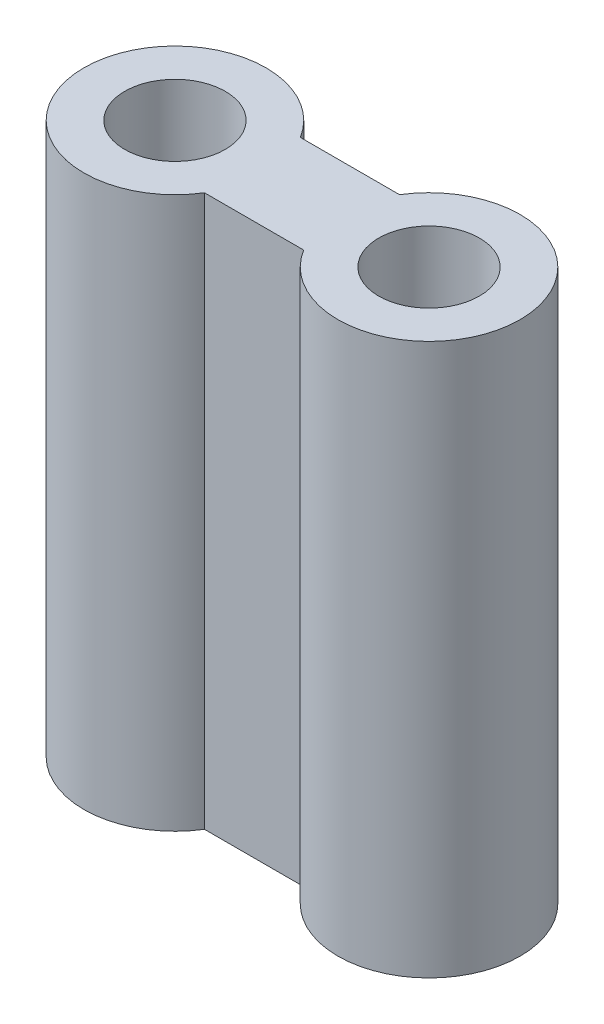
ISO-10303-21;
HEADER;
FILE_DESCRIPTION(('STEP AP214'),'2;1');
FILE_NAME('part.step','',(''),(''),'','','');
FILE_SCHEMA(('AUTOMOTIVE_DESIGN { 1 0 10303 214 1 1 1 1 }'));
ENDSEC;
DATA;
#1=APPLICATION_CONTEXT('core data for automotive mechanical design processes');
#2=APPLICATION_PROTOCOL_DEFINITION('international standard','automotive_design',2000,#1);
#3=PRODUCT_CONTEXT('',#1,'mechanical');
#4=PRODUCT('Part','Part','',(#3));
#5=PRODUCT_RELATED_PRODUCT_CATEGORY('part','',(#4));
#6=PRODUCT_DEFINITION_FORMATION('','',#4);
#7=PRODUCT_DEFINITION_CONTEXT('part definition',#1,'design');
#8=PRODUCT_DEFINITION('design','',#6,#7);
#9=PRODUCT_DEFINITION_SHAPE('','',#8);
#10=(LENGTH_UNIT() NAMED_UNIT(*) SI_UNIT(.MILLI.,.METRE.));
#11=(NAMED_UNIT(*) PLANE_ANGLE_UNIT() SI_UNIT($,.RADIAN.));
#12=(NAMED_UNIT(*) SI_UNIT($,.STERADIAN.) SOLID_ANGLE_UNIT());
#13=UNCERTAINTY_MEASURE_WITH_UNIT(LENGTH_MEASURE(1.E-05),#10,'distance_accuracy_value','');
#14=(GEOMETRIC_REPRESENTATION_CONTEXT(3) GLOBAL_UNCERTAINTY_ASSIGNED_CONTEXT((#13)) GLOBAL_UNIT_ASSIGNED_CONTEXT((#10,
#11,#12)) REPRESENTATION_CONTEXT('',''));
#15=CARTESIAN_POINT('',(0.,0.,0.));
#16=DIRECTION('',(0.,0.,1.));
#17=DIRECTION('',(1.,0.,0.));
#18=AXIS2_PLACEMENT_3D('',#15,#16,#17);
#19=CARTESIAN_POINT('',(6.78906067548967,11.5,12.3912239564282));
#20=DIRECTION('',(0.,-1.,0.));
#21=DIRECTION('',(0.,0.,-1.));
#22=AXIS2_PLACEMENT_3D('',#19,#20,#21);
#23=CYLINDRICAL_SURFACE('',#22,1.9);
#24=CARTESIAN_POINT('',(6.78906067548967,0.,12.3912239564282));
#25=DIRECTION('',(0.,1.,0.));
#26=DIRECTION('',(1.,0.,0.));
#27=AXIS2_PLACEMENT_3D('',#24,#25,#26);
#28=CIRCLE('',#27,1.9);
#29=CARTESIAN_POINT('',(8.40461011763003,0.,11.3912239564282));
#30=VERTEX_POINT('',#29);
#31=CARTESIAN_POINT('',(8.40461011763003,0.,13.3912239564282));
#32=VERTEX_POINT('',#31);
#33=EDGE_CURVE('E87',#30,#32,#28,.T.);
#34=ORIENTED_EDGE('',*,*,#33,.T.);
#35=DIRECTION('',(0.,-1.,0.));
#36=VECTOR('',#35,1.);
#37=CARTESIAN_POINT('',(8.40461011763003,11.5,13.3912239564282));
#38=LINE('',#37,#36);
#39=CARTESIAN_POINT('',(8.40461011763003,11.5,13.3912239564282));
#40=VERTEX_POINT('',#39);
#41=EDGE_CURVE('E9',#40,#32,#38,.T.);
#42=ORIENTED_EDGE('',*,*,#41,.F.);
#43=CARTESIAN_POINT('',(6.78906067548967,11.5,12.3912239564282));
#44=DIRECTION('',(0.,1.,0.));
#45=DIRECTION('',(1.,0.,0.));
#46=AXIS2_PLACEMENT_3D('',#43,#44,#45);
#47=CIRCLE('',#46,1.9);
#48=CARTESIAN_POINT('',(8.40461011763003,11.5,11.3912239564282));
#49=VERTEX_POINT('',#48);
#50=EDGE_CURVE('E66',#49,#40,#47,.T.);
#51=ORIENTED_EDGE('',*,*,#50,.F.);
#52=DIRECTION('',(0.,-1.,0.));
#53=VECTOR('',#52,1.);
#54=CARTESIAN_POINT('',(8.40461011763003,11.5,11.3912239564282));
#55=LINE('',#54,#53);
#56=EDGE_CURVE('E84',#49,#30,#55,.T.);
#57=ORIENTED_EDGE('',*,*,#56,.T.);
#58=EDGE_LOOP('',(#34,#42,#51,#57));
#59=FACE_BOUND('',#58,.T.);
#60=ADVANCED_FACE('F15',(#59),#23,.T.);
#61=CARTESIAN_POINT('',(8.40461011763003,11.5,13.3912239564282));
#62=DIRECTION('',(0.,0.,-1.));
#63=DIRECTION('',(-1.,0.,0.));
#64=AXIS2_PLACEMENT_3D('',#61,#62,#63);
#65=PLANE('',#64);
#66=DIRECTION('',(1.,0.,0.));
#67=VECTOR('',#66,1.);
#68=CARTESIAN_POINT('',(8.40461011763003,0.,13.3912239564282));
#69=LINE('',#68,#67);
#70=CARTESIAN_POINT('',(10.4735112333493,0.,13.3912239564282));
#71=VERTEX_POINT('',#70);
#72=EDGE_CURVE('E70',#32,#71,#69,.T.);
#73=ORIENTED_EDGE('',*,*,#72,.T.);
#74=DIRECTION('',(0.,-1.,0.));
#75=VECTOR('',#74,1.);
#76=CARTESIAN_POINT('',(10.4735112333493,11.5,13.3912239564282));
#77=LINE('',#76,#75);
#78=CARTESIAN_POINT('',(10.4735112333493,11.5,13.3912239564282));
#79=VERTEX_POINT('',#78);
#80=EDGE_CURVE('E23',#79,#71,#77,.T.);
#81=ORIENTED_EDGE('',*,*,#80,.F.);
#82=DIRECTION('',(1.,0.,0.));
#83=VECTOR('',#82,1.);
#84=CARTESIAN_POINT('',(8.40461011763003,11.5,13.3912239564282));
#85=LINE('',#84,#83);
#86=EDGE_CURVE('E61',#40,#79,#85,.T.);
#87=ORIENTED_EDGE('',*,*,#86,.F.);
#88=ORIENTED_EDGE('',*,*,#41,.T.);
#89=EDGE_LOOP('',(#73,#81,#87,#88));
#90=FACE_BOUND('',#89,.T.);
#91=ADVANCED_FACE('F69',(#90),#65,.F.);
#92=CARTESIAN_POINT('',(12.0890606754897,11.5,12.3912239564282));
#93=DIRECTION('',(0.,-1.,0.));
#94=DIRECTION('',(0.,0.,-1.));
#95=AXIS2_PLACEMENT_3D('',#92,#93,#94);
#96=CYLINDRICAL_SURFACE('',#95,1.9);
#97=CARTESIAN_POINT('',(12.0890606754897,0.,12.3912239564282));
#98=DIRECTION('',(0.,1.,0.));
#99=DIRECTION('',(-1.,0.,0.));
#100=AXIS2_PLACEMENT_3D('',#97,#98,#99);
#101=CIRCLE('',#100,1.9);
#102=CARTESIAN_POINT('',(10.4735112333493,0.,11.3912239564282));
#103=VERTEX_POINT('',#102);
#104=EDGE_CURVE('E48',#71,#103,#101,.T.);
#105=ORIENTED_EDGE('',*,*,#104,.T.);
#106=DIRECTION('',(0.,-1.,0.));
#107=VECTOR('',#106,1.);
#108=CARTESIAN_POINT('',(10.4735112333493,11.5,11.3912239564282));
#109=LINE('',#108,#107);
#110=CARTESIAN_POINT('',(10.4735112333493,11.5,11.3912239564282));
#111=VERTEX_POINT('',#110);
#112=EDGE_CURVE('E71',#111,#103,#109,.T.);
#113=ORIENTED_EDGE('',*,*,#112,.F.);
#114=CARTESIAN_POINT('',(12.0890606754897,11.5,12.3912239564282));
#115=DIRECTION('',(0.,1.,0.));
#116=DIRECTION('',(-1.,0.,0.));
#117=AXIS2_PLACEMENT_3D('',#114,#115,#116);
#118=CIRCLE('',#117,1.9);
#119=EDGE_CURVE('E64',#79,#111,#118,.T.);
#120=ORIENTED_EDGE('',*,*,#119,.F.);
#121=ORIENTED_EDGE('',*,*,#80,.T.);
#122=EDGE_LOOP('',(#105,#113,#120,#121));
#123=FACE_BOUND('',#122,.T.);
#124=ADVANCED_FACE('F72',(#123),#96,.T.);
#125=CARTESIAN_POINT('',(6.78906067548967,11.5,12.3912239564282));
#126=DIRECTION('',(0.,-1.,0.));
#127=DIRECTION('',(0.,0.,-1.));
#128=AXIS2_PLACEMENT_3D('',#125,#126,#127);
#129=CYLINDRICAL_SURFACE('',#128,1.05);
#130=CARTESIAN_POINT('',(6.78906067548967,11.5,12.3912239564282));
#131=DIRECTION('',(0.,1.,0.));
#132=DIRECTION('',(1.,0.,0.));
#133=AXIS2_PLACEMENT_3D('',#130,#131,#132);
#134=CIRCLE('',#133,1.05);
#135=CARTESIAN_POINT('',(7.83906067548967,11.5,12.3912239564282));
#136=VERTEX_POINT('',#135);
#137=EDGE_CURVE('E74',#136,#136,#134,.T.);
#138=ORIENTED_EDGE('',*,*,#137,.T.);
#139=EDGE_LOOP('',(#138));
#140=FACE_BOUND('',#139,.T.);
#141=CARTESIAN_POINT('',(6.78906067548967,0.,12.3912239564282));
#142=DIRECTION('',(0.,1.,0.));
#143=DIRECTION('',(1.,0.,0.));
#144=AXIS2_PLACEMENT_3D('',#141,#142,#143);
#145=CIRCLE('',#144,1.05);
#146=CARTESIAN_POINT('',(7.83906067548967,0.,12.3912239564282));
#147=VERTEX_POINT('',#146);
#148=EDGE_CURVE('E92',#147,#147,#145,.T.);
#149=ORIENTED_EDGE('',*,*,#148,.F.);
#150=EDGE_LOOP('',(#149));
#151=FACE_BOUND('',#150,.T.);
#152=ADVANCED_FACE('F116',(#140,#151),#129,.F.);
#153=CARTESIAN_POINT('',(12.0890606754897,11.5,12.3912239564282));
#154=DIRECTION('',(0.,-1.,0.));
#155=DIRECTION('',(0.,0.,-1.));
#156=AXIS2_PLACEMENT_3D('',#153,#154,#155);
#157=CYLINDRICAL_SURFACE('',#156,1.05);
#158=CARTESIAN_POINT('',(12.0890606754897,11.5,12.3912239564282));
#159=DIRECTION('',(0.,1.,0.));
#160=DIRECTION('',(1.,0.,0.));
#161=AXIS2_PLACEMENT_3D('',#158,#159,#160);
#162=CIRCLE('',#161,1.05);
#163=CARTESIAN_POINT('',(13.1390606754897,11.5,12.3912239564282));
#164=VERTEX_POINT('',#163);
#165=EDGE_CURVE('E81',#164,#164,#162,.T.);
#166=ORIENTED_EDGE('',*,*,#165,.T.);
#167=EDGE_LOOP('',(#166));
#168=FACE_BOUND('',#167,.T.);
#169=CARTESIAN_POINT('',(12.0890606754897,0.,12.3912239564282));
#170=DIRECTION('',(0.,1.,0.));
#171=DIRECTION('',(1.,0.,0.));
#172=AXIS2_PLACEMENT_3D('',#169,#170,#171);
#173=CIRCLE('',#172,1.05);
#174=CARTESIAN_POINT('',(13.1390606754897,0.,12.3912239564282));
#175=VERTEX_POINT('',#174);
#176=EDGE_CURVE('E78',#175,#175,#173,.T.);
#177=ORIENTED_EDGE('',*,*,#176,.F.);
#178=EDGE_LOOP('',(#177));
#179=FACE_BOUND('',#178,.T.);
#180=ADVANCED_FACE('F121',(#168,#179),#157,.F.);
#181=CARTESIAN_POINT('',(10.4735112333493,11.5,11.3912239564282));
#182=DIRECTION('',(0.,0.,1.));
#183=DIRECTION('',(1.,0.,0.));
#184=AXIS2_PLACEMENT_3D('',#181,#182,#183);
#185=PLANE('',#184);
#186=DIRECTION('',(-1.,0.,0.));
#187=VECTOR('',#186,1.);
#188=CARTESIAN_POINT('',(10.4735112333493,0.,11.3912239564282));
#189=LINE('',#188,#187);
#190=EDGE_CURVE('E54',#103,#30,#189,.T.);
#191=ORIENTED_EDGE('',*,*,#190,.T.);
#192=ORIENTED_EDGE('',*,*,#56,.F.);
#193=DIRECTION('',(-1.,0.,0.));
#194=VECTOR('',#193,1.);
#195=CARTESIAN_POINT('',(10.4735112333493,11.5,11.3912239564282));
#196=LINE('',#195,#194);
#197=EDGE_CURVE('E31',#111,#49,#196,.T.);
#198=ORIENTED_EDGE('',*,*,#197,.F.);
#199=ORIENTED_EDGE('',*,*,#112,.T.);
#200=EDGE_LOOP('',(#191,#192,#198,#199));
#201=FACE_BOUND('',#200,.T.);
#202=ADVANCED_FACE('F103',(#201),#185,.F.);
#203=CARTESIAN_POINT('',(6.78906067548967,11.5,12.3912239564282));
#204=DIRECTION('',(0.,1.,0.));
#205=DIRECTION('',(0.,0.,1.));
#206=AXIS2_PLACEMENT_3D('',#203,#204,#205);
#207=PLANE('',#206);
#208=ORIENTED_EDGE('',*,*,#165,.F.);
#209=EDGE_LOOP('',(#208));
#210=FACE_BOUND('',#209,.T.);
#211=ORIENTED_EDGE('',*,*,#137,.F.);
#212=EDGE_LOOP('',(#211));
#213=FACE_BOUND('',#212,.T.);
#214=ORIENTED_EDGE('',*,*,#50,.T.);
#215=ORIENTED_EDGE('',*,*,#86,.T.);
#216=ORIENTED_EDGE('',*,*,#119,.T.);
#217=ORIENTED_EDGE('',*,*,#197,.T.);
#218=EDGE_LOOP('',(#214,#215,#216,#217));
#219=FACE_BOUND('',#218,.T.);
#220=ADVANCED_FACE('F62',(#210,#213,#219),#207,.T.);
#221=CARTESIAN_POINT('',(6.78906067548967,0.,12.3912239564282));
#222=DIRECTION('',(0.,1.,0.));
#223=DIRECTION('',(0.,0.,1.));
#224=AXIS2_PLACEMENT_3D('',#221,#222,#223);
#225=PLANE('',#224);
#226=ORIENTED_EDGE('',*,*,#176,.T.);
#227=EDGE_LOOP('',(#226));
#228=FACE_BOUND('',#227,.T.);
#229=ORIENTED_EDGE('',*,*,#148,.T.);
#230=EDGE_LOOP('',(#229));
#231=FACE_BOUND('',#230,.T.);
#232=ORIENTED_EDGE('',*,*,#33,.F.);
#233=ORIENTED_EDGE('',*,*,#190,.F.);
#234=ORIENTED_EDGE('',*,*,#104,.F.);
#235=ORIENTED_EDGE('',*,*,#72,.F.);
#236=EDGE_LOOP('',(#232,#233,#234,#235));
#237=FACE_BOUND('',#236,.T.);
#238=ADVANCED_FACE('F106',(#228,#231,#237),#225,.F.);
#239=CLOSED_SHELL('',(#60,#91,#124,#152,#180,#202,#220,#238));
#240=MANIFOLD_SOLID_BREP('B1',#239);
#241=ADVANCED_BREP_SHAPE_REPRESENTATION('',(#18,#240),#14);
#242=SHAPE_DEFINITION_REPRESENTATION(#9,#241);
ENDSEC;
END-ISO-10303-21;
